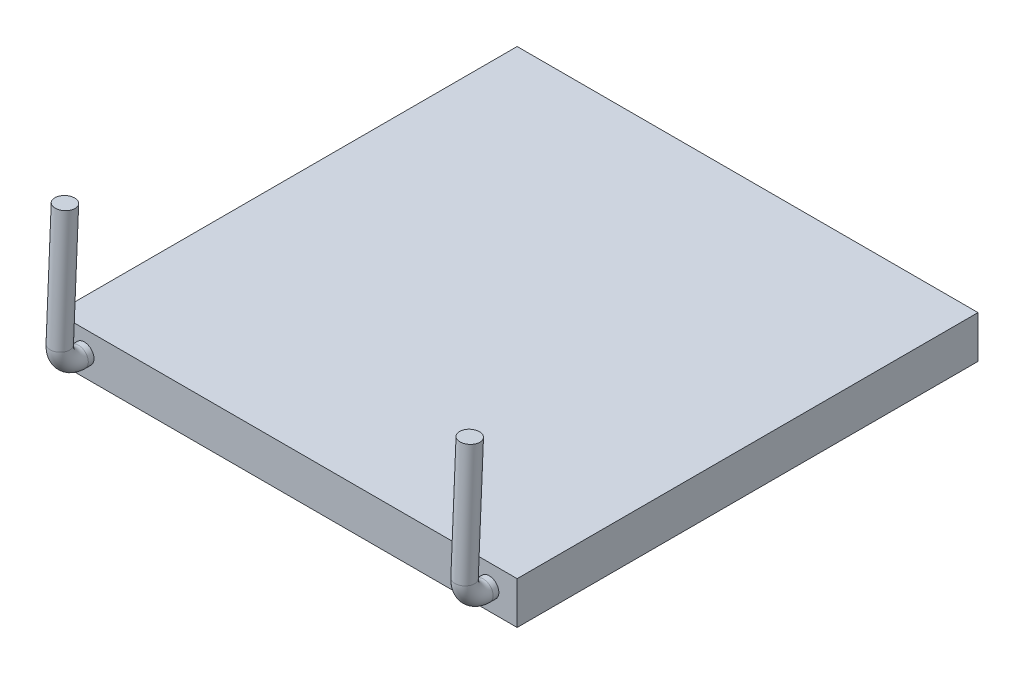
ISO-10303-21;
HEADER;
FILE_DESCRIPTION(('STEP AP214'),'2;1');
FILE_NAME('part.step','',(''),(''),'','','');
FILE_SCHEMA(('AUTOMOTIVE_DESIGN { 1 0 10303 214 1 1 1 1 }'));
ENDSEC;
DATA;
#1=APPLICATION_CONTEXT('core data for automotive mechanical design processes');
#2=APPLICATION_PROTOCOL_DEFINITION('international standard','automotive_design',2000,#1);
#3=PRODUCT_CONTEXT('',#1,'mechanical');
#4=PRODUCT('Part','Part','',(#3));
#5=PRODUCT_RELATED_PRODUCT_CATEGORY('part','',(#4));
#6=PRODUCT_DEFINITION_FORMATION('','',#4);
#7=PRODUCT_DEFINITION_CONTEXT('part definition',#1,'design');
#8=PRODUCT_DEFINITION('design','',#6,#7);
#9=PRODUCT_DEFINITION_SHAPE('','',#8);
#10=(LENGTH_UNIT() NAMED_UNIT(*) SI_UNIT(.MILLI.,.METRE.));
#11=(NAMED_UNIT(*) PLANE_ANGLE_UNIT() SI_UNIT($,.RADIAN.));
#12=(NAMED_UNIT(*) SI_UNIT($,.STERADIAN.) SOLID_ANGLE_UNIT());
#13=UNCERTAINTY_MEASURE_WITH_UNIT(LENGTH_MEASURE(1.E-05),#10,'distance_accuracy_value','');
#14=(GEOMETRIC_REPRESENTATION_CONTEXT(3) GLOBAL_UNCERTAINTY_ASSIGNED_CONTEXT((#13)) GLOBAL_UNIT_ASSIGNED_CONTEXT((#10,
#11,#12)) REPRESENTATION_CONTEXT('',''));
#15=CARTESIAN_POINT('',(0.,0.,0.));
#16=DIRECTION('',(0.,0.,1.));
#17=DIRECTION('',(1.,0.,0.));
#18=AXIS2_PLACEMENT_3D('',#15,#16,#17);
#19=CARTESIAN_POINT('',(-20.15,3.7,20.15));
#20=DIRECTION('',(0.,0.,-1.));
#21=DIRECTION('',(-1.,0.,0.));
#22=AXIS2_PLACEMENT_3D('',#19,#20,#21);
#23=PLANE('',#22);
#24=CARTESIAN_POINT('',(17.7,1.85,20.15));
#25=DIRECTION('',(0.,0.,-1.));
#26=DIRECTION('',(-1.,0.,0.));
#27=AXIS2_PLACEMENT_3D('',#24,#25,#26);
#28=CIRCLE('',#27,0.85);
#29=CARTESIAN_POINT('',(16.85,1.85,20.15));
#30=VERTEX_POINT('',#29);
#31=EDGE_CURVE('E238',#30,#30,#28,.T.);
#32=ORIENTED_EDGE('',*,*,#31,.T.);
#33=EDGE_LOOP('',(#32));
#34=FACE_BOUND('',#33,.T.);
#35=DIRECTION('',(1.,0.,0.));
#36=VECTOR('',#35,1.);
#37=CARTESIAN_POINT('',(-20.15,0.,20.15));
#38=LINE('',#37,#36);
#39=CARTESIAN_POINT('',(-20.15,0.,20.15));
#40=VERTEX_POINT('',#39);
#41=CARTESIAN_POINT('',(20.15,0.,20.15));
#42=VERTEX_POINT('',#41);
#43=EDGE_CURVE('E73',#40,#42,#38,.T.);
#44=ORIENTED_EDGE('',*,*,#43,.T.);
#45=DIRECTION('',(0.,-1.,0.));
#46=VECTOR('',#45,1.);
#47=CARTESIAN_POINT('',(20.15,3.7,20.15));
#48=LINE('',#47,#46);
#49=CARTESIAN_POINT('',(20.15,3.7,20.15));
#50=VERTEX_POINT('',#49);
#51=EDGE_CURVE('E96',#50,#42,#48,.T.);
#52=ORIENTED_EDGE('',*,*,#51,.F.);
#53=DIRECTION('',(1.,0.,0.));
#54=VECTOR('',#53,1.);
#55=CARTESIAN_POINT('',(-20.15,3.7,20.15));
#56=LINE('',#55,#54);
#57=CARTESIAN_POINT('',(-20.15,3.7,20.15));
#58=VERTEX_POINT('',#57);
#59=EDGE_CURVE('E50',#58,#50,#56,.T.);
#60=ORIENTED_EDGE('',*,*,#59,.F.);
#61=DIRECTION('',(0.,-1.,0.));
#62=VECTOR('',#61,1.);
#63=CARTESIAN_POINT('',(-20.15,3.7,20.15));
#64=LINE('',#63,#62);
#65=EDGE_CURVE('E92',#58,#40,#64,.T.);
#66=ORIENTED_EDGE('',*,*,#65,.T.);
#67=EDGE_LOOP('',(#44,#52,#60,#66));
#68=FACE_BOUND('',#67,.T.);
#69=CARTESIAN_POINT('',(-17.7,1.85,20.15));
#70=DIRECTION('',(0.,0.,-1.));
#71=DIRECTION('',(-1.,0.,0.));
#72=AXIS2_PLACEMENT_3D('',#69,#70,#71);
#73=CIRCLE('',#72,0.85);
#74=CARTESIAN_POINT('',(-18.55,1.85,20.15));
#75=VERTEX_POINT('',#74);
#76=EDGE_CURVE('E11',#75,#75,#73,.F.);
#77=ORIENTED_EDGE('',*,*,#76,.F.);
#78=EDGE_LOOP('',(#77));
#79=FACE_BOUND('',#78,.T.);
#80=ADVANCED_FACE('F32',(#34,#68,#79),#23,.F.);
#81=CARTESIAN_POINT('',(20.15,3.7,-20.15));
#82=DIRECTION('',(-1.,0.,0.));
#83=DIRECTION('',(0.,0.,1.));
#84=AXIS2_PLACEMENT_3D('',#81,#82,#83);
#85=PLANE('',#84);
#86=DIRECTION('',(0.,0.,-1.));
#87=VECTOR('',#86,1.);
#88=CARTESIAN_POINT('',(20.15,0.,-20.15));
#89=LINE('',#88,#87);
#90=CARTESIAN_POINT('',(20.15,0.,-20.15));
#91=VERTEX_POINT('',#90);
#92=EDGE_CURVE('E100',#42,#91,#89,.T.);
#93=ORIENTED_EDGE('',*,*,#92,.T.);
#94=DIRECTION('',(0.,-1.,0.));
#95=VECTOR('',#94,1.);
#96=CARTESIAN_POINT('',(20.15,3.7,-20.15));
#97=LINE('',#96,#95);
#98=CARTESIAN_POINT('',(20.15,3.7,-20.15));
#99=VERTEX_POINT('',#98);
#100=EDGE_CURVE('E42',#99,#91,#97,.T.);
#101=ORIENTED_EDGE('',*,*,#100,.F.);
#102=DIRECTION('',(0.,0.,-1.));
#103=VECTOR('',#102,1.);
#104=CARTESIAN_POINT('',(20.15,3.7,-20.15));
#105=LINE('',#104,#103);
#106=EDGE_CURVE('E86',#50,#99,#105,.T.);
#107=ORIENTED_EDGE('',*,*,#106,.F.);
#108=ORIENTED_EDGE('',*,*,#51,.T.);
#109=EDGE_LOOP('',(#93,#101,#107,#108));
#110=FACE_BOUND('',#109,.T.);
#111=ADVANCED_FACE('F34',(#110),#85,.F.);
#112=CARTESIAN_POINT('',(-20.15,3.7,-20.15));
#113=DIRECTION('',(0.,0.,1.));
#114=DIRECTION('',(1.,0.,0.));
#115=AXIS2_PLACEMENT_3D('',#112,#113,#114);
#116=PLANE('',#115);
#117=DIRECTION('',(-1.,0.,0.));
#118=VECTOR('',#117,1.);
#119=CARTESIAN_POINT('',(-20.15,0.,-20.15));
#120=LINE('',#119,#118);
#121=CARTESIAN_POINT('',(-20.15,0.,-20.15));
#122=VERTEX_POINT('',#121);
#123=EDGE_CURVE('E91',#91,#122,#120,.T.);
#124=ORIENTED_EDGE('',*,*,#123,.T.);
#125=DIRECTION('',(0.,-1.,0.));
#126=VECTOR('',#125,1.);
#127=CARTESIAN_POINT('',(-20.15,3.7,-20.15));
#128=LINE('',#127,#126);
#129=CARTESIAN_POINT('',(-20.15,3.7,-20.15));
#130=VERTEX_POINT('',#129);
#131=EDGE_CURVE('E89',#130,#122,#128,.T.);
#132=ORIENTED_EDGE('',*,*,#131,.F.);
#133=DIRECTION('',(-1.,0.,0.));
#134=VECTOR('',#133,1.);
#135=CARTESIAN_POINT('',(-20.15,3.7,-20.15));
#136=LINE('',#135,#134);
#137=EDGE_CURVE('E81',#99,#130,#136,.T.);
#138=ORIENTED_EDGE('',*,*,#137,.F.);
#139=ORIENTED_EDGE('',*,*,#100,.T.);
#140=EDGE_LOOP('',(#124,#132,#138,#139));
#141=FACE_BOUND('',#140,.T.);
#142=ADVANCED_FACE('F90',(#141),#116,.F.);
#143=CARTESIAN_POINT('',(-20.15,3.7,-20.15));
#144=DIRECTION('',(1.,0.,0.));
#145=DIRECTION('',(0.,0.,-1.));
#146=AXIS2_PLACEMENT_3D('',#143,#144,#145);
#147=PLANE('',#146);
#148=DIRECTION('',(0.,0.,1.));
#149=VECTOR('',#148,1.);
#150=CARTESIAN_POINT('',(-20.15,0.,-20.15));
#151=LINE('',#150,#149);
#152=EDGE_CURVE('E67',#122,#40,#151,.T.);
#153=ORIENTED_EDGE('',*,*,#152,.T.);
#154=ORIENTED_EDGE('',*,*,#65,.F.);
#155=DIRECTION('',(0.,0.,1.));
#156=VECTOR('',#155,1.);
#157=CARTESIAN_POINT('',(-20.15,3.7,-20.15));
#158=LINE('',#157,#156);
#159=EDGE_CURVE('E84',#130,#58,#158,.T.);
#160=ORIENTED_EDGE('',*,*,#159,.F.);
#161=ORIENTED_EDGE('',*,*,#131,.T.);
#162=EDGE_LOOP('',(#153,#154,#160,#161));
#163=FACE_BOUND('',#162,.T.);
#164=ADVANCED_FACE('F94',(#163),#147,.F.);
#165=CARTESIAN_POINT('',(0.,3.7,0.));
#166=DIRECTION('',(0.,1.,0.));
#167=DIRECTION('',(0.,0.,1.));
#168=AXIS2_PLACEMENT_3D('',#165,#166,#167);
#169=PLANE('',#168);
#170=ORIENTED_EDGE('',*,*,#106,.T.);
#171=ORIENTED_EDGE('',*,*,#137,.T.);
#172=ORIENTED_EDGE('',*,*,#159,.T.);
#173=ORIENTED_EDGE('',*,*,#59,.T.);
#174=EDGE_LOOP('',(#170,#171,#172,#173));
#175=FACE_BOUND('',#174,.T.);
#176=ADVANCED_FACE('F82',(#175),#169,.T.);
#177=CARTESIAN_POINT('',(0.,0.,0.));
#178=DIRECTION('',(0.,1.,0.));
#179=DIRECTION('',(0.,0.,1.));
#180=AXIS2_PLACEMENT_3D('',#177,#178,#179);
#181=PLANE('',#180);
#182=ORIENTED_EDGE('',*,*,#92,.F.);
#183=ORIENTED_EDGE('',*,*,#43,.F.);
#184=ORIENTED_EDGE('',*,*,#152,.F.);
#185=ORIENTED_EDGE('',*,*,#123,.F.);
#186=EDGE_LOOP('',(#182,#183,#184,#185));
#187=FACE_BOUND('',#186,.T.);
#188=ADVANCED_FACE('F111',(#187),#181,.F.);
#189=CARTESIAN_POINT('',(-17.7,1.85,20.65));
#190=DIRECTION('',(0.,0.,-1.));
#191=DIRECTION('',(-1.,0.,0.));
#192=AXIS2_PLACEMENT_3D('',#189,#190,#191);
#193=CYLINDRICAL_SURFACE('',#192,0.85);
#194=CARTESIAN_POINT('',(-17.7,1.85,20.65));
#195=DIRECTION('',(0.,0.,1.));
#196=DIRECTION('',(1.,0.,0.));
#197=AXIS2_PLACEMENT_3D('',#194,#195,#196);
#198=CIRCLE('',#197,0.85);
#199=CARTESIAN_POINT('',(-17.7,1.,20.65));
#200=VERTEX_POINT('',#199);
#201=EDGE_CURVE('E36',#200,#200,#198,.T.);
#202=ORIENTED_EDGE('',*,*,#201,.F.);
#203=EDGE_LOOP('',(#202));
#204=FACE_BOUND('',#203,.T.);
#205=ORIENTED_EDGE('',*,*,#76,.T.);
#206=EDGE_LOOP('',(#205));
#207=FACE_BOUND('',#206,.T.);
#208=ADVANCED_FACE('F113',(#204,#207),#193,.T.);
#209=CARTESIAN_POINT('',(-17.7,3.5015628353161,20.65));
#210=DIRECTION('',(1.,0.,0.));
#211=DIRECTION('',(0.,0.,-1.));
#212=AXIS2_PLACEMENT_3D('',#209,#210,#211);
#213=TOROIDAL_SURFACE('',#212,1.6515628353161,0.85);
#214=CARTESIAN_POINT('',(-17.7,3.57339457619274,22.3));
#215=DIRECTION('',(0.,0.999053723368748,-0.0434931928356733));
#216=DIRECTION('',(1.,0.,0.));
#217=AXIS2_PLACEMENT_3D('',#214,#215,#216);
#218=CIRCLE('',#217,0.85);
#219=CARTESIAN_POINT('',(-17.7,3.61036379010306,23.1491956648634));
#220=VERTEX_POINT('',#219);
#221=EDGE_CURVE('E248',#220,#220,#218,.T.);
#222=CARTESIAN_POINT('',(-17.7,3.5015628353161,20.65));
#223=DIRECTION('',(1.,0.,0.));
#224=DIRECTION('',(0.,0.,-1.));
#225=AXIS2_PLACEMENT_3D('',#222,#223,#224);
#226=CIRCLE('',#225,2.5015628353161);
#227=EDGE_CURVE('',#220,#200,#226,.T.);
#228=ORIENTED_EDGE('',*,*,#221,.F.);
#229=ORIENTED_EDGE('',*,*,#201,.T.);
#230=ORIENTED_EDGE('',*,*,#227,.T.);
#231=ORIENTED_EDGE('',*,*,#227,.F.);
#232=EDGE_LOOP('',(#228,#230,#229,#231));
#233=FACE_BOUND('',#232,.T.);
#234=ADVANCED_FACE('F119',(#233),#213,.T.);
#235=CARTESIAN_POINT('',(-17.7,14.0634586715646,21.8433214752254));
#236=DIRECTION('',(0.,-0.999053723368748,0.0434931928356733));
#237=DIRECTION('',(0.,-0.0434931928356733,-0.999053723368748));
#238=AXIS2_PLACEMENT_3D('',#235,#236,#237);
#239=CYLINDRICAL_SURFACE('',#238,0.85);
#240=CARTESIAN_POINT('',(-17.7,14.0634586715646,21.8433214752254));
#241=DIRECTION('',(0.,0.999053723368748,-0.0434931928356733));
#242=DIRECTION('',(0.,0.0434931928356733,0.999053723368748));
#243=AXIS2_PLACEMENT_3D('',#240,#241,#242);
#244=CIRCLE('',#243,0.85);
#245=CARTESIAN_POINT('',(-17.7,14.1004278854749,22.6925171400889));
#246=VERTEX_POINT('',#245);
#247=EDGE_CURVE('E244',#246,#246,#244,.T.);
#248=ORIENTED_EDGE('',*,*,#247,.F.);
#249=EDGE_LOOP('',(#248));
#250=FACE_BOUND('',#249,.T.);
#251=ORIENTED_EDGE('',*,*,#221,.T.);
#252=EDGE_LOOP('',(#251));
#253=FACE_BOUND('',#252,.T.);
#254=ADVANCED_FACE('F165',(#250,#253),#239,.T.);
#255=CARTESIAN_POINT('',(-17.7,14.0634586715646,21.8433214752254));
#256=DIRECTION('',(0.,0.999053723368748,-0.0434931928356733));
#257=DIRECTION('',(0.,0.0434931928356733,0.999053723368748));
#258=AXIS2_PLACEMENT_3D('',#255,#256,#257);
#259=PLANE('',#258);
#260=ORIENTED_EDGE('',*,*,#247,.T.);
#261=EDGE_LOOP('',(#260));
#262=FACE_BOUND('',#261,.T.);
#263=ADVANCED_FACE('F175',(#262),#259,.T.);
#264=CARTESIAN_POINT('',(17.7,1.85,20.65));
#265=DIRECTION('',(0.,0.,-1.));
#266=DIRECTION('',(-1.,0.,0.));
#267=AXIS2_PLACEMENT_3D('',#264,#265,#266);
#268=CYLINDRICAL_SURFACE('',#267,0.85);
#269=CARTESIAN_POINT('',(17.7,1.85,20.65));
#270=DIRECTION('',(0.,0.,-1.));
#271=DIRECTION('',(-1.,0.,0.));
#272=AXIS2_PLACEMENT_3D('',#269,#270,#271);
#273=CIRCLE('',#272,0.85);
#274=CARTESIAN_POINT('',(17.7,1.,20.65));
#275=VERTEX_POINT('',#274);
#276=EDGE_CURVE('E241',#275,#275,#273,.T.);
#277=ORIENTED_EDGE('',*,*,#276,.T.);
#278=EDGE_LOOP('',(#277));
#279=FACE_BOUND('',#278,.T.);
#280=ORIENTED_EDGE('',*,*,#31,.F.);
#281=EDGE_LOOP('',(#280));
#282=FACE_BOUND('',#281,.T.);
#283=ADVANCED_FACE('F184',(#279,#282),#268,.T.);
#284=CARTESIAN_POINT('',(17.7,3.5015628353161,20.65));
#285=DIRECTION('',(1.,0.,0.));
#286=DIRECTION('',(0.,0.,-1.));
#287=AXIS2_PLACEMENT_3D('',#284,#285,#286);
#288=TOROIDAL_SURFACE('',#287,1.6515628353161,0.85);
#289=CARTESIAN_POINT('',(17.7,3.57339457619274,22.3));
#290=DIRECTION('',(0.,-0.999053723368748,0.0434931928356733));
#291=DIRECTION('',(-1.,0.,0.));
#292=AXIS2_PLACEMENT_3D('',#289,#290,#291);
#293=CIRCLE('',#292,0.85);
#294=CARTESIAN_POINT('',(17.7,3.61036379010306,23.1491956648634));
#295=VERTEX_POINT('',#294);
#296=EDGE_CURVE('E235',#295,#295,#293,.T.);
#297=CARTESIAN_POINT('',(17.7,3.5015628353161,20.65));
#298=DIRECTION('',(1.,0.,0.));
#299=DIRECTION('',(0.,0.,-1.));
#300=AXIS2_PLACEMENT_3D('',#297,#298,#299);
#301=CIRCLE('',#300,2.5015628353161);
#302=EDGE_CURVE('',#295,#275,#301,.T.);
#303=ORIENTED_EDGE('',*,*,#296,.T.);
#304=ORIENTED_EDGE('',*,*,#276,.F.);
#305=ORIENTED_EDGE('',*,*,#302,.T.);
#306=ORIENTED_EDGE('',*,*,#302,.F.);
#307=EDGE_LOOP('',(#303,#305,#304,#306));
#308=FACE_BOUND('',#307,.T.);
#309=ADVANCED_FACE('F198',(#308),#288,.T.);
#310=CARTESIAN_POINT('',(17.7,14.0634586715646,21.8433214752254));
#311=DIRECTION('',(0.,-0.999053723368748,0.0434931928356733));
#312=DIRECTION('',(0.,-0.0434931928356733,-0.999053723368748));
#313=AXIS2_PLACEMENT_3D('',#310,#311,#312);
#314=CYLINDRICAL_SURFACE('',#313,0.85);
#315=CARTESIAN_POINT('',(17.7,14.0634586715646,21.8433214752254));
#316=DIRECTION('',(0.,-0.999053723368748,0.0434931928356733));
#317=DIRECTION('',(0.,0.0434931928356733,0.999053723368748));
#318=AXIS2_PLACEMENT_3D('',#315,#316,#317);
#319=CIRCLE('',#318,0.85);
#320=CARTESIAN_POINT('',(17.7,14.1004278854749,22.6925171400889));
#321=VERTEX_POINT('',#320);
#322=EDGE_CURVE('E234',#321,#321,#319,.T.);
#323=ORIENTED_EDGE('',*,*,#322,.T.);
#324=EDGE_LOOP('',(#323));
#325=FACE_BOUND('',#324,.T.);
#326=ORIENTED_EDGE('',*,*,#296,.F.);
#327=EDGE_LOOP('',(#326));
#328=FACE_BOUND('',#327,.T.);
#329=ADVANCED_FACE('F208',(#325,#328),#314,.T.);
#330=CARTESIAN_POINT('',(17.7,14.0634586715646,21.8433214752254));
#331=DIRECTION('',(0.,0.999053723368748,-0.0434931928356733));
#332=DIRECTION('',(0.,0.0434931928356733,0.999053723368748));
#333=AXIS2_PLACEMENT_3D('',#330,#331,#332);
#334=PLANE('',#333);
#335=ORIENTED_EDGE('',*,*,#322,.F.);
#336=EDGE_LOOP('',(#335));
#337=FACE_BOUND('',#336,.T.);
#338=ADVANCED_FACE('F218',(#337),#334,.T.);
#339=CLOSED_SHELL('',(#80,#111,#142,#164,#176,#188,#208,#234,#254,#263,#283,#309,#329,#338));
#340=MANIFOLD_SOLID_BREP('B2',#339);
#341=ADVANCED_BREP_SHAPE_REPRESENTATION('',(#18,#340),#14);
#342=SHAPE_DEFINITION_REPRESENTATION(#9,#341);
ENDSEC;
END-ISO-10303-21;
